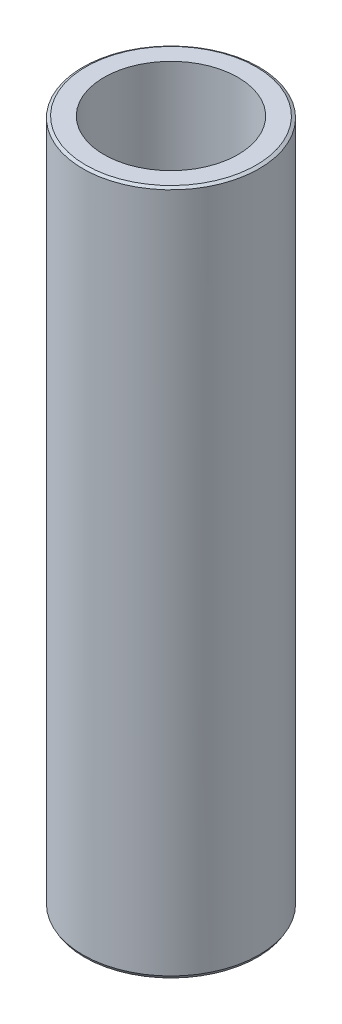
ISO-10303-21;
HEADER;
FILE_DESCRIPTION(('STEP AP214'),'2;1');
FILE_NAME('part.step','',(''),(''),'','','');
FILE_SCHEMA(('AUTOMOTIVE_DESIGN { 1 0 10303 214 1 1 1 1 }'));
ENDSEC;
DATA;
#1=APPLICATION_CONTEXT('core data for automotive mechanical design processes');
#2=APPLICATION_PROTOCOL_DEFINITION('international standard','automotive_design',2000,#1);
#3=PRODUCT_CONTEXT('',#1,'mechanical');
#4=PRODUCT('Part','Part','',(#3));
#5=PRODUCT_RELATED_PRODUCT_CATEGORY('part','',(#4));
#6=PRODUCT_DEFINITION_FORMATION('','',#4);
#7=PRODUCT_DEFINITION_CONTEXT('part definition',#1,'design');
#8=PRODUCT_DEFINITION('design','',#6,#7);
#9=PRODUCT_DEFINITION_SHAPE('','',#8);
#10=(LENGTH_UNIT() NAMED_UNIT(*) SI_UNIT(.MILLI.,.METRE.));
#11=(NAMED_UNIT(*) PLANE_ANGLE_UNIT() SI_UNIT($,.RADIAN.));
#12=(NAMED_UNIT(*) SI_UNIT($,.STERADIAN.) SOLID_ANGLE_UNIT());
#13=UNCERTAINTY_MEASURE_WITH_UNIT(LENGTH_MEASURE(1.E-05),#10,'distance_accuracy_value','');
#14=(GEOMETRIC_REPRESENTATION_CONTEXT(3) GLOBAL_UNCERTAINTY_ASSIGNED_CONTEXT((#13)) GLOBAL_UNIT_ASSIGNED_CONTEXT((#10,
#11,#12)) REPRESENTATION_CONTEXT('',''));
#15=CARTESIAN_POINT('',(0.,0.,0.));
#16=DIRECTION('',(0.,0.,1.));
#17=DIRECTION('',(1.,0.,0.));
#18=AXIS2_PLACEMENT_3D('',#15,#16,#17);
#19=CARTESIAN_POINT('',(0.,427.916587073117,0.));
#20=DIRECTION('',(0.,-1.,0.));
#21=DIRECTION('',(0.,0.,-1.));
#22=AXIS2_PLACEMENT_3D('',#19,#20,#21);
#23=CYLINDRICAL_SURFACE('',#22,55.);
#24=CARTESIAN_POINT('',(0.,426.867210607107,0.));
#25=DIRECTION('',(0.,1.,0.));
#26=DIRECTION('',(0.,0.,1.));
#27=AXIS2_PLACEMENT_3D('',#24,#25,#26);
#28=CIRCLE('',#27,55.);
#29=CARTESIAN_POINT('',(0.,426.867210607107,-55.));
#30=VERTEX_POINT('',#29);
#31=EDGE_CURVE('E50',#30,#30,#28,.F.);
#32=CARTESIAN_POINT('',(0.,1.81757335539817,0.));
#33=DIRECTION('',(0.,1.,0.));
#34=DIRECTION('',(0.,0.,1.));
#35=AXIS2_PLACEMENT_3D('',#32,#33,#34);
#36=CIRCLE('',#35,55.);
#37=CARTESIAN_POINT('',(0.,1.81757335539817,-55.));
#38=VERTEX_POINT('',#37);
#39=EDGE_CURVE('E51',#38,#38,#36,.T.);
#40=CARTESIAN_POINT('',(0.,426.867210607107,-55.));
#41=CARTESIAN_POINT('',(0.,422.439610219068,-55.));
#42=CARTESIAN_POINT('',(0.,418.01200983103,-55.));
#43=CARTESIAN_POINT('',(0.,409.156809054952,-55.));
#44=CARTESIAN_POINT('',(0.,404.729208666914,-55.));
#45=CARTESIAN_POINT('',(0.,395.874007890836,-55.));
#46=CARTESIAN_POINT('',(0.,391.446407502798,-55.));
#47=CARTESIAN_POINT('',(0.,382.59120672672,-55.));
#48=CARTESIAN_POINT('',(0.,378.163606338682,-55.));
#49=CARTESIAN_POINT('',(0.,369.308405562605,-55.));
#50=CARTESIAN_POINT('',(0.,364.880805174566,-55.));
#51=CARTESIAN_POINT('',(0.,356.025604398489,-55.));
#52=CARTESIAN_POINT('',(0.,351.59800401045,-55.));
#53=CARTESIAN_POINT('',(0.,342.742803234373,-55.));
#54=CARTESIAN_POINT('',(0.,338.315202846334,-55.));
#55=CARTESIAN_POINT('',(0.,329.460002070257,-55.));
#56=CARTESIAN_POINT('',(0.,325.032401682218,-55.));
#57=CARTESIAN_POINT('',(0.,316.177200906141,-55.));
#58=CARTESIAN_POINT('',(0.,311.749600518102,-55.));
#59=CARTESIAN_POINT('',(0.,302.894399742025,-55.));
#60=CARTESIAN_POINT('',(0.,298.466799353987,-55.));
#61=CARTESIAN_POINT('',(0.,289.611598577909,-55.));
#62=CARTESIAN_POINT('',(0.,285.183998189871,-55.));
#63=CARTESIAN_POINT('',(0.,276.328797413793,-55.));
#64=CARTESIAN_POINT('',(0.,271.901197025755,-55.));
#65=CARTESIAN_POINT('',(0.,263.045996249677,-55.));
#66=CARTESIAN_POINT('',(0.,258.618395861639,-55.));
#67=CARTESIAN_POINT('',(0.,249.763195085562,-55.));
#68=CARTESIAN_POINT('',(0.,245.335594697523,-55.));
#69=CARTESIAN_POINT('',(0.,236.480393921446,-55.));
#70=CARTESIAN_POINT('',(0.,232.052793533407,-55.));
#71=CARTESIAN_POINT('',(0.,223.19759275733,-55.));
#72=CARTESIAN_POINT('',(0.,218.769992369291,-55.));
#73=CARTESIAN_POINT('',(0.,209.914791593214,-55.));
#74=CARTESIAN_POINT('',(0.,205.487191205175,-55.));
#75=CARTESIAN_POINT('',(0.,196.631990429098,-55.));
#76=CARTESIAN_POINT('',(0.,192.204390041059,-55.));
#77=CARTESIAN_POINT('',(0.,183.349189264982,-55.));
#78=CARTESIAN_POINT('',(0.,178.921588876943,-55.));
#79=CARTESIAN_POINT('',(0.,170.066388100866,-55.));
#80=CARTESIAN_POINT('',(0.,165.638787712828,-55.));
#81=CARTESIAN_POINT('',(0.,156.78358693675,-55.));
#82=CARTESIAN_POINT('',(0.,152.355986548712,-55.));
#83=CARTESIAN_POINT('',(0.,143.500785772634,-55.));
#84=CARTESIAN_POINT('',(0.,139.073185384596,-55.));
#85=CARTESIAN_POINT('',(0.,130.217984608518,-55.));
#86=CARTESIAN_POINT('',(0.,125.79038422048,-55.));
#87=CARTESIAN_POINT('',(0.,116.935183444403,-55.));
#88=CARTESIAN_POINT('',(0.,112.507583056364,-55.));
#89=CARTESIAN_POINT('',(0.,103.652382280287,-55.));
#90=CARTESIAN_POINT('',(0.,99.2247818922481,-55.));
#91=CARTESIAN_POINT('',(0.,90.3695811161709,-55.));
#92=CARTESIAN_POINT('',(0.,85.9419807281322,-55.));
#93=CARTESIAN_POINT('',(0.,77.0867799520549,-55.));
#94=CARTESIAN_POINT('',(0.,72.6591795640163,-55.));
#95=CARTESIAN_POINT('',(0.,63.8039787879391,-55.));
#96=CARTESIAN_POINT('',(0.,59.3763783999004,-55.));
#97=CARTESIAN_POINT('',(0.,50.5211776238232,-55.));
#98=CARTESIAN_POINT('',(0.,46.0935772357845,-55.));
#99=CARTESIAN_POINT('',(0.,37.2383764597073,-55.));
#100=CARTESIAN_POINT('',(0.,32.8107760716686,-55.));
#101=CARTESIAN_POINT('',(0.,23.9555752955914,-55.));
#102=CARTESIAN_POINT('',(0.,19.5279749075527,-55.));
#103=CARTESIAN_POINT('',(0.,10.6727741314755,-55.));
#104=CARTESIAN_POINT('',(0.,6.24517374343682,-55.));
#105=CARTESIAN_POINT('',(0.,1.81757335539817,-55.));
#106=B_SPLINE_CURVE_WITH_KNOTS('',3,(#40,#41,#42,#43,#44,#45,#46,#47,#48,#49,#50,#51,#52,#53,
#54,#55,#56,#57,#58,#59,#60,#61,#62,#63,#64,#65,#66,#67,#68,#69,#70,#71,#72,#73,#74,#75,#76,#77,
#78,#79,#80,#81,#82,#83,#84,#85,#86,#87,#88,#89,#90,#91,#92,#93,#94,#95,#96,#97,#98,#99,#100,
#101,#102,#103,#104,#105),.UNSPECIFIED.,.F.,.F.,(4,2,2,2,2,2,2,2,2,2,2,2,2,2,2,2,2,2,2,2,2,2,2,
2,2,2,2,2,2,2,2,2,4),(0.,13.2828011641159,26.5656023282318,39.8484034923477,53.1312046564636,
66.4140058205795,79.6968069846954,92.9796081488113,106.262409312927,119.545210477043,
132.828011641159,146.110812805275,159.393613969391,172.676415133507,185.959216297623,
199.242017461738,212.524818625854,225.80761978997,239.090420954086,252.373222118202,
265.656023282318,278.938824446434,292.22162561055,305.504426774666,318.787227938781,
332.070029102897,345.352830267013,358.635631431129,371.918432595245,385.201233759361,
398.484034923477,411.766836087593,425.049637251709),.UNSPECIFIED.);
#107=EDGE_CURVE('BSEAM39',#30,#38,#106,.T.);
#108=ORIENTED_EDGE('',*,*,#31,.T.);
#109=ORIENTED_EDGE('',*,*,#39,.T.);
#110=ORIENTED_EDGE('',*,*,#107,.T.);
#111=ORIENTED_EDGE('',*,*,#107,.F.);
#112=EDGE_LOOP('',(#108,#110,#109,#111));
#113=FACE_BOUND('',#112,.T.);
#114=ADVANCED_FACE('F39',(#113),#23,.T.);
#115=CARTESIAN_POINT('',(0.,427.916587073117,0.));
#116=DIRECTION('',(0.,1.,0.));
#117=DIRECTION('',(0.,0.,1.));
#118=AXIS2_PLACEMENT_3D('',#115,#116,#117);
#119=PLANE('',#118);
#120=CARTESIAN_POINT('',(0.,427.916587073117,0.));
#121=DIRECTION('',(0.,1.,0.));
#122=DIRECTION('',(0.,0.,1.));
#123=AXIS2_PLACEMENT_3D('',#120,#121,#122);
#124=CIRCLE('',#123,53.1824266446026);
#125=CARTESIAN_POINT('',(0.,427.916587073117,53.1824266446026));
#126=VERTEX_POINT('',#125);
#127=EDGE_CURVE('E54',#126,#126,#124,.T.);
#128=ORIENTED_EDGE('',*,*,#127,.T.);
#129=EDGE_LOOP('',(#128));
#130=FACE_BOUND('',#129,.T.);
#131=CARTESIAN_POINT('',(0.,427.916587073117,0.));
#132=DIRECTION('',(0.,1.,0.));
#133=DIRECTION('',(0.,0.,1.));
#134=AXIS2_PLACEMENT_3D('',#131,#132,#133);
#135=CIRCLE('',#134,41.8181767828505);
#136=CARTESIAN_POINT('',(0.,427.916587073117,-41.8181767828505));
#137=VERTEX_POINT('',#136);
#138=EDGE_CURVE('E58',#137,#137,#135,.T.);
#139=ORIENTED_EDGE('',*,*,#138,.F.);
#140=EDGE_LOOP('',(#139));
#141=FACE_BOUND('',#140,.T.);
#142=ADVANCED_FACE('F69',(#130,#141),#119,.T.);
#143=CARTESIAN_POINT('',(0.,0.,0.));
#144=DIRECTION('',(0.,1.,0.));
#145=DIRECTION('',(0.,0.,1.));
#146=AXIS2_PLACEMENT_3D('',#143,#144,#145);
#147=PLANE('',#146);
#148=CARTESIAN_POINT('',(0.,0.,0.));
#149=DIRECTION('',(0.,1.,0.));
#150=DIRECTION('',(0.,0.,1.));
#151=AXIS2_PLACEMENT_3D('',#148,#149,#150);
#152=CIRCLE('',#151,53.950623533989);
#153=CARTESIAN_POINT('',(0.,0.,53.950623533989));
#154=VERTEX_POINT('',#153);
#155=EDGE_CURVE('E10',#154,#154,#152,.F.);
#156=ORIENTED_EDGE('',*,*,#155,.T.);
#157=EDGE_LOOP('',(#156));
#158=FACE_BOUND('',#157,.T.);
#159=CARTESIAN_POINT('',(0.,0.,0.));
#160=DIRECTION('',(0.,1.,0.));
#161=DIRECTION('',(0.,0.,1.));
#162=AXIS2_PLACEMENT_3D('',#159,#160,#161);
#163=CIRCLE('',#162,41.8181767828505);
#164=CARTESIAN_POINT('',(0.,0.,-41.8181767828505));
#165=VERTEX_POINT('',#164);
#166=EDGE_CURVE('E63',#165,#165,#163,.T.);
#167=ORIENTED_EDGE('',*,*,#166,.T.);
#168=EDGE_LOOP('',(#167));
#169=FACE_BOUND('',#168,.T.);
#170=ADVANCED_FACE('F75',(#158,#169),#147,.F.);
#171=CARTESIAN_POINT('',(0.,427.916587073117,0.));
#172=DIRECTION('',(0.,-1.,0.));
#173=DIRECTION('',(0.,0.,-1.));
#174=AXIS2_PLACEMENT_3D('',#171,#172,#173);
#175=CYLINDRICAL_SURFACE('',#174,41.8181767828505);
#176=CARTESIAN_POINT('',(0.,427.916587073117,-41.8181767828505));
#177=CARTESIAN_POINT('',(0.,423.459122624439,-41.8181767828505));
#178=CARTESIAN_POINT('',(0.,419.001658175761,-41.8181767828505));
#179=CARTESIAN_POINT('',(0.,410.086729278404,-41.8181767828505));
#180=CARTESIAN_POINT('',(0.,405.629264829726,-41.8181767828505));
#181=CARTESIAN_POINT('',(0.,396.714335932369,-41.8181767828505));
#182=CARTESIAN_POINT('',(0.,392.256871483691,-41.8181767828505));
#183=CARTESIAN_POINT('',(0.,383.341942586334,-41.8181767828505));
#184=CARTESIAN_POINT('',(0.,378.884478137656,-41.8181767828505));
#185=CARTESIAN_POINT('',(0.,369.969549240299,-41.8181767828505));
#186=CARTESIAN_POINT('',(0.,365.512084791621,-41.8181767828505));
#187=CARTESIAN_POINT('',(0.,356.597155894265,-41.8181767828505));
#188=CARTESIAN_POINT('',(0.,352.139691445586,-41.8181767828505));
#189=CARTESIAN_POINT('',(0.,343.22476254823,-41.8181767828505));
#190=CARTESIAN_POINT('',(0.,338.767298099551,-41.8181767828505));
#191=CARTESIAN_POINT('',(0.,329.852369202195,-41.8181767828505));
#192=CARTESIAN_POINT('',(0.,325.394904753516,-41.8181767828505));
#193=CARTESIAN_POINT('',(0.,316.47997585616,-41.8181767828505));
#194=CARTESIAN_POINT('',(0.,312.022511407481,-41.8181767828505));
#195=CARTESIAN_POINT('',(0.,303.107582510125,-41.8181767828505));
#196=CARTESIAN_POINT('',(0.,298.650118061447,-41.8181767828505));
#197=CARTESIAN_POINT('',(0.,289.73518916409,-41.8181767828505));
#198=CARTESIAN_POINT('',(0.,285.277724715412,-41.8181767828505));
#199=CARTESIAN_POINT('',(0.,276.362795818055,-41.8181767828505));
#200=CARTESIAN_POINT('',(0.,271.905331369377,-41.8181767828505));
#201=CARTESIAN_POINT('',(0.,262.99040247202,-41.8181767828505));
#202=CARTESIAN_POINT('',(0.,258.532938023342,-41.8181767828505));
#203=CARTESIAN_POINT('',(0.,249.618009125985,-41.8181767828505));
#204=CARTESIAN_POINT('',(0.,245.160544677307,-41.8181767828505));
#205=CARTESIAN_POINT('',(0.,236.24561577995,-41.8181767828505));
#206=CARTESIAN_POINT('',(0.,231.788151331272,-41.8181767828505));
#207=CARTESIAN_POINT('',(0.,222.873222433915,-41.8181767828505));
#208=CARTESIAN_POINT('',(0.,218.415757985237,-41.8181767828505));
#209=CARTESIAN_POINT('',(0.,209.50082908788,-41.8181767828505));
#210=CARTESIAN_POINT('',(0.,205.043364639202,-41.8181767828505));
#211=CARTESIAN_POINT('',(0.,196.128435741845,-41.8181767828505));
#212=CARTESIAN_POINT('',(0.,191.670971293167,-41.8181767828505));
#213=CARTESIAN_POINT('',(0.,182.756042395811,-41.8181767828505));
#214=CARTESIAN_POINT('',(0.,178.298577947132,-41.8181767828505));
#215=CARTESIAN_POINT('',(0.,169.383649049776,-41.8181767828505));
#216=CARTESIAN_POINT('',(0.,164.926184601097,-41.8181767828505));
#217=CARTESIAN_POINT('',(0.,156.011255703741,-41.8181767828505));
#218=CARTESIAN_POINT('',(0.,151.553791255062,-41.8181767828505));
#219=CARTESIAN_POINT('',(0.,142.638862357706,-41.8181767828505));
#220=CARTESIAN_POINT('',(0.,138.181397909027,-41.8181767828505));
#221=CARTESIAN_POINT('',(0.,129.266469011671,-41.8181767828505));
#222=CARTESIAN_POINT('',(0.,124.809004562993,-41.8181767828505));
#223=CARTESIAN_POINT('',(0.,115.894075665636,-41.8181767828505));
#224=CARTESIAN_POINT('',(0.,111.436611216958,-41.8181767828505));
#225=CARTESIAN_POINT('',(0.,102.521682319601,-41.8181767828505));
#226=CARTESIAN_POINT('',(0.,98.0642178709227,-41.8181767828505));
#227=CARTESIAN_POINT('',(0.,89.1492889735661,-41.8181767828505));
#228=CARTESIAN_POINT('',(0.,84.6918245248878,-41.8181767828505));
#229=CARTESIAN_POINT('',(0.,75.7768956275312,-41.8181767828505));
#230=CARTESIAN_POINT('',(0.,71.3194311788529,-41.8181767828505));
#231=CARTESIAN_POINT('',(0.,62.4045022814962,-41.8181767828505));
#232=CARTESIAN_POINT('',(0.,57.9470378328179,-41.8181767828505));
#233=CARTESIAN_POINT('',(0.,49.0321089354613,-41.8181767828505));
#234=CARTESIAN_POINT('',(0.,44.574644486783,-41.8181767828505));
#235=CARTESIAN_POINT('',(0.,35.6597155894264,-41.8181767828505));
#236=CARTESIAN_POINT('',(0.,31.2022511407481,-41.8181767828505));
#237=CARTESIAN_POINT('',(0.,22.2873222433915,-41.8181767828505));
#238=CARTESIAN_POINT('',(0.,17.8298577947132,-41.8181767828505));
#239=CARTESIAN_POINT('',(0.,8.91492889735655,-41.8181767828505));
#240=CARTESIAN_POINT('',(0.,4.45746444867824,-41.8181767828505));
#241=CARTESIAN_POINT('',(0.,0.,-41.8181767828505));
#242=B_SPLINE_CURVE_WITH_KNOTS('',3,(#176,#177,#178,#179,#180,#181,#182,#183,#184,#185,#186,
#187,#188,#189,#190,#191,#192,#193,#194,#195,#196,#197,#198,#199,#200,#201,#202,#203,#204,#205,
#206,#207,#208,#209,#210,#211,#212,#213,#214,#215,#216,#217,#218,#219,#220,#221,#222,#223,#224,
#225,#226,#227,#228,#229,#230,#231,#232,#233,#234,#235,#236,#237,#238,#239,#240,#241),
.UNSPECIFIED.,.F.,.F.,(4,2,2,2,2,2,2,2,2,2,2,2,2,2,2,2,2,2,2,2,2,2,2,2,2,2,2,2,2,2,2,2,4),(0.,
13.3723933460349,26.7447866920698,40.1171800381047,53.4895733841397,66.8619667301746,
80.2343600762095,93.6067534222444,106.979146768279,120.351540114314,133.723933460349,
147.096326806384,160.468720152419,173.841113498454,187.213506844489,200.585900190524,
213.958293536559,227.330686882594,240.703080228629,254.075473574663,267.447866920698,
280.820260266733,294.192653612768,307.565046958803,320.937440304838,334.309833650873,
347.682226996908,361.054620342943,374.427013688978,387.799407035013,401.171800381048,
414.544193727083,427.916587073117),.UNSPECIFIED.);
#243=EDGE_CURVE('BSEAM70',#137,#165,#242,.T.);
#244=ORIENTED_EDGE('',*,*,#138,.T.);
#245=ORIENTED_EDGE('',*,*,#166,.F.);
#246=ORIENTED_EDGE('',*,*,#243,.T.);
#247=ORIENTED_EDGE('',*,*,#243,.F.);
#248=EDGE_LOOP('',(#244,#246,#245,#247));
#249=FACE_BOUND('',#248,.T.);
#250=ADVANCED_FACE('F70',(#249),#175,.F.);
#251=CARTESIAN_POINT('',(0.,427.916587073117,0.));
#252=DIRECTION('',(0.,-1.,0.));
#253=DIRECTION('',(0.,0.,-1.));
#254=AXIS2_PLACEMENT_3D('',#251,#252,#253);
#255=CONICAL_SURFACE('',#254,53.1824266446026,1.04719755119657);
#256=ORIENTED_EDGE('',*,*,#31,.F.);
#257=EDGE_LOOP('',(#256));
#258=FACE_BOUND('',#257,.T.);
#259=ORIENTED_EDGE('',*,*,#127,.F.);
#260=EDGE_LOOP('',(#259));
#261=FACE_BOUND('',#260,.T.);
#262=ADVANCED_FACE('F81',(#258,#261),#255,.T.);
#263=CARTESIAN_POINT('',(0.,1.81757335539817,0.));
#264=DIRECTION('',(0.,1.,0.));
#265=DIRECTION('',(0.,0.,1.));
#266=AXIS2_PLACEMENT_3D('',#263,#264,#265);
#267=CONICAL_SURFACE('',#266,55.,0.523598775598305);
#268=ORIENTED_EDGE('',*,*,#155,.F.);
#269=EDGE_LOOP('',(#268));
#270=FACE_BOUND('',#269,.T.);
#271=ORIENTED_EDGE('',*,*,#39,.F.);
#272=EDGE_LOOP('',(#271));
#273=FACE_BOUND('',#272,.T.);
#274=ADVANCED_FACE('F45',(#270,#273),#267,.T.);
#275=CLOSED_SHELL('',(#114,#142,#170,#250,#262,#274));
#276=MANIFOLD_SOLID_BREP('B2',#275);
#277=ADVANCED_BREP_SHAPE_REPRESENTATION('',(#18,#276),#14);
#278=SHAPE_DEFINITION_REPRESENTATION(#9,#277);
ENDSEC;
END-ISO-10303-21;
